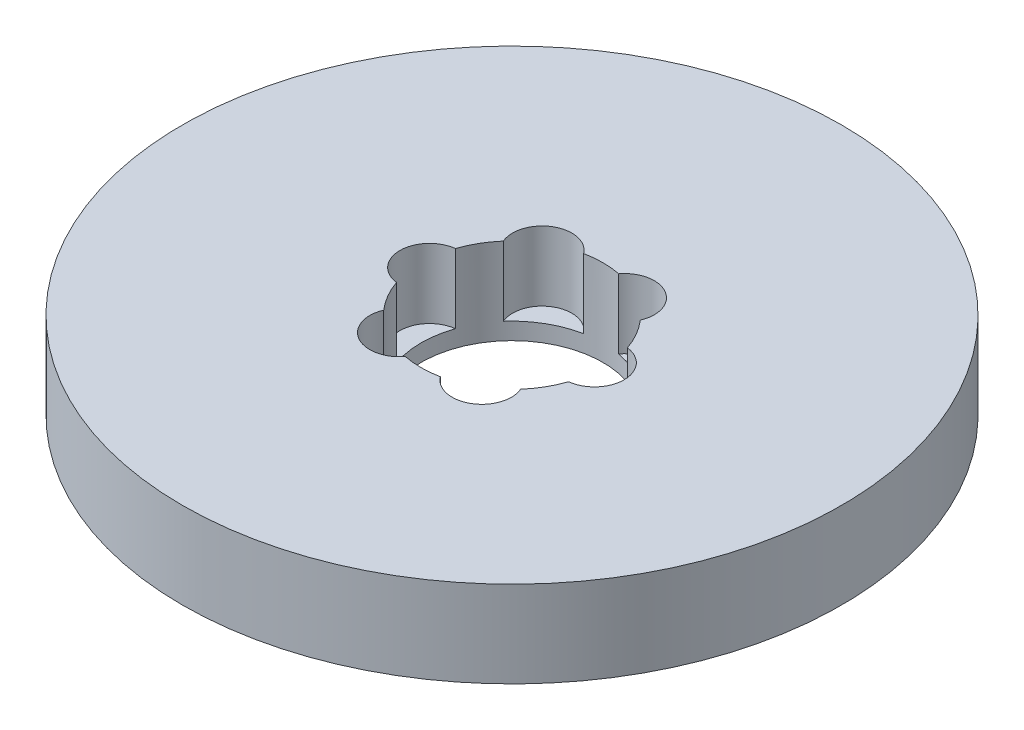
ISO-10303-21;
HEADER;
FILE_DESCRIPTION(('STEP AP214'),'2;1');
FILE_NAME('part.step','',(''),(''),'','','');
FILE_SCHEMA(('AUTOMOTIVE_DESIGN { 1 0 10303 214 1 1 1 1 }'));
ENDSEC;
DATA;
#1=APPLICATION_CONTEXT('core data for automotive mechanical design processes');
#2=APPLICATION_PROTOCOL_DEFINITION('international standard','automotive_design',2000,#1);
#3=PRODUCT_CONTEXT('',#1,'mechanical');
#4=PRODUCT('Part','Part','',(#3));
#5=PRODUCT_RELATED_PRODUCT_CATEGORY('part','',(#4));
#6=PRODUCT_DEFINITION_FORMATION('','',#4);
#7=PRODUCT_DEFINITION_CONTEXT('part definition',#1,'design');
#8=PRODUCT_DEFINITION('design','',#6,#7);
#9=PRODUCT_DEFINITION_SHAPE('','',#8);
#10=(LENGTH_UNIT() NAMED_UNIT(*) SI_UNIT(.MILLI.,.METRE.));
#11=(NAMED_UNIT(*) PLANE_ANGLE_UNIT() SI_UNIT($,.RADIAN.));
#12=(NAMED_UNIT(*) SI_UNIT($,.STERADIAN.) SOLID_ANGLE_UNIT());
#13=UNCERTAINTY_MEASURE_WITH_UNIT(LENGTH_MEASURE(1.E-05),#10,'distance_accuracy_value','');
#14=(GEOMETRIC_REPRESENTATION_CONTEXT(3) GLOBAL_UNCERTAINTY_ASSIGNED_CONTEXT((#13)) GLOBAL_UNIT_ASSIGNED_CONTEXT((#10,
#11,#12)) REPRESENTATION_CONTEXT('',''));
#15=CARTESIAN_POINT('',(0.,0.,0.));
#16=DIRECTION('',(0.,0.,1.));
#17=DIRECTION('',(1.,0.,0.));
#18=AXIS2_PLACEMENT_3D('',#15,#16,#17);
#19=CARTESIAN_POINT('',(0.,19.,0.));
#20=DIRECTION('',(0.,-1.,0.));
#21=DIRECTION('',(0.,0.,-1.));
#22=AXIS2_PLACEMENT_3D('',#19,#20,#21);
#23=CYLINDRICAL_SURFACE('',#22,72.5);
#24=CARTESIAN_POINT('',(0.,19.,0.));
#25=DIRECTION('',(0.,1.,0.));
#26=DIRECTION('',(0.,0.,1.));
#27=AXIS2_PLACEMENT_3D('',#24,#25,#26);
#28=CIRCLE('',#27,72.5);
#29=CARTESIAN_POINT('',(0.,19.,72.5));
#30=VERTEX_POINT('',#29);
#31=EDGE_CURVE('E162',#30,#30,#28,.T.);
#32=ORIENTED_EDGE('',*,*,#31,.F.);
#33=EDGE_LOOP('',(#32));
#34=FACE_BOUND('',#33,.T.);
#35=CARTESIAN_POINT('',(0.,0.,0.));
#36=DIRECTION('',(0.,1.,0.));
#37=DIRECTION('',(0.,0.,1.));
#38=AXIS2_PLACEMENT_3D('',#35,#36,#37);
#39=CIRCLE('',#38,72.5);
#40=CARTESIAN_POINT('',(0.,0.,72.5));
#41=VERTEX_POINT('',#40);
#42=EDGE_CURVE('E157',#41,#41,#39,.T.);
#43=ORIENTED_EDGE('',*,*,#42,.T.);
#44=EDGE_LOOP('',(#43));
#45=FACE_BOUND('',#44,.T.);
#46=ADVANCED_FACE('F39',(#34,#45),#23,.T.);
#47=CARTESIAN_POINT('',(0.,19.,0.));
#48=DIRECTION('',(0.,1.,0.));
#49=DIRECTION('',(0.,0.,1.));
#50=AXIS2_PLACEMENT_3D('',#47,#48,#49);
#51=PLANE('',#50);
#52=CARTESIAN_POINT('',(-9.06860523652961,19.,-15.707285023454));
#53=DIRECTION('',(0.,1.,0.));
#54=DIRECTION('',(-0.866025403784433,0.,0.50000000000001));
#55=AXIS2_PLACEMENT_3D('',#52,#53,#54);
#56=CIRCLE('',#55,6.5172243467947);
#57=CARTESIAN_POINT('',(-3.85965017921883,19.,-19.624043938344));
#58=VERTEX_POINT('',#57);
#59=CARTESIAN_POINT('',(-15.0650954859788,19.,-13.1545770740963));
#60=VERTEX_POINT('',#59);
#61=EDGE_CURVE('E218',#58,#60,#56,.T.);
#62=ORIENTED_EDGE('',*,*,#61,.F.);
#63=CARTESIAN_POINT('',(0.,19.,0.));
#64=DIRECTION('',(0.,1.,0.));
#65=DIRECTION('',(0.,0.,1.));
#66=AXIS2_PLACEMENT_3D('',#63,#64,#65);
#67=CIRCLE('',#66,20.);
#68=CARTESIAN_POINT('',(3.85965017921842,19.,-19.6240439383441));
#69=VERTEX_POINT('',#68);
#70=EDGE_CURVE('E169',#69,#58,#67,.T.);
#71=ORIENTED_EDGE('',*,*,#70,.F.);
#72=CARTESIAN_POINT('',(9.06860523652928,19.,-15.7072850234542));
#73=DIRECTION('',(0.,1.,0.));
#74=DIRECTION('',(-0.866025403784443,0.,-0.499999999999992));
#75=AXIS2_PLACEMENT_3D('',#72,#73,#74);
#76=CIRCLE('',#75,6.5172243467947);
#77=CARTESIAN_POINT('',(15.0650954859785,19.,-13.1545770740966));
#78=VERTEX_POINT('',#77);
#79=EDGE_CURVE('E285',#78,#69,#76,.T.);
#80=ORIENTED_EDGE('',*,*,#79,.F.);
#81=CARTESIAN_POINT('',(18.9247456651973,19.,-6.46946686424756));
#82=VERTEX_POINT('',#81);
#83=EDGE_CURVE('E174',#82,#78,#67,.T.);
#84=ORIENTED_EDGE('',*,*,#83,.F.);
#85=CARTESIAN_POINT('',(18.1372104730589,19.,0.));
#86=DIRECTION('',(0.,1.,0.));
#87=DIRECTION('',(0.,0.,-1.));
#88=AXIS2_PLACEMENT_3D('',#85,#86,#87);
#89=CIRCLE('',#88,6.5172243467947);
#90=CARTESIAN_POINT('',(18.9247456651973,19.,6.46946686424756));
#91=VERTEX_POINT('',#90);
#92=EDGE_CURVE('E280',#91,#82,#89,.T.);
#93=ORIENTED_EDGE('',*,*,#92,.F.);
#94=CARTESIAN_POINT('',(15.0650954859787,19.,13.1545770740964));
#95=VERTEX_POINT('',#94);
#96=EDGE_CURVE('E164',#95,#91,#67,.T.);
#97=ORIENTED_EDGE('',*,*,#96,.F.);
#98=CARTESIAN_POINT('',(9.0686052365295,19.,15.7072850234541));
#99=DIRECTION('',(0.,1.,0.));
#100=DIRECTION('',(0.866025403784436,0.,-0.500000000000004));
#101=AXIS2_PLACEMENT_3D('',#98,#99,#100);
#102=CIRCLE('',#101,6.5172243467947);
#103=CARTESIAN_POINT('',(3.85965017921869,19.,19.624043938344));
#104=VERTEX_POINT('',#103);
#105=EDGE_CURVE('E269',#104,#95,#102,.T.);
#106=ORIENTED_EDGE('',*,*,#105,.F.);
#107=CARTESIAN_POINT('',(-3.85965017921856,19.,19.6240439383441));
#108=VERTEX_POINT('',#107);
#109=EDGE_CURVE('E149',#108,#104,#67,.T.);
#110=ORIENTED_EDGE('',*,*,#109,.F.);
#111=CARTESIAN_POINT('',(-9.06860523652939,19.,15.7072850234542));
#112=DIRECTION('',(0.,1.,0.));
#113=DIRECTION('',(0.86602540378444,0.,0.499999999999998));
#114=AXIS2_PLACEMENT_3D('',#111,#112,#113);
#115=CIRCLE('',#114,6.5172243467947);
#116=CARTESIAN_POINT('',(-15.0650954859786,19.,13.1545770740965));
#117=VERTEX_POINT('',#116);
#118=EDGE_CURVE('E128',#117,#108,#115,.T.);
#119=ORIENTED_EDGE('',*,*,#118,.F.);
#120=CARTESIAN_POINT('',(-18.9247456651973,19.,6.46946686424756));
#121=VERTEX_POINT('',#120);
#122=EDGE_CURVE('E148',#121,#117,#67,.T.);
#123=ORIENTED_EDGE('',*,*,#122,.F.);
#124=CARTESIAN_POINT('',(-18.1372104730589,19.,0.));
#125=DIRECTION('',(0.,1.,0.));
#126=DIRECTION('',(0.,0.,1.));
#127=AXIS2_PLACEMENT_3D('',#124,#125,#126);
#128=CIRCLE('',#127,6.5172243467947);
#129=CARTESIAN_POINT('',(-18.9247456651973,19.,-6.46946686424756));
#130=VERTEX_POINT('',#129);
#131=EDGE_CURVE('E179',#130,#121,#128,.T.);
#132=ORIENTED_EDGE('',*,*,#131,.F.);
#133=EDGE_CURVE('E161',#60,#130,#67,.T.);
#134=ORIENTED_EDGE('',*,*,#133,.F.);
#135=EDGE_LOOP('',(#62,#71,#80,#84,#93,#97,#106,#110,#119,#123,#132,#134));
#136=FACE_BOUND('',#135,.T.);
#137=ORIENTED_EDGE('',*,*,#31,.T.);
#138=EDGE_LOOP('',(#137));
#139=FACE_BOUND('',#138,.T.);
#140=ADVANCED_FACE('F141',(#136,#139),#51,.T.);
#141=CARTESIAN_POINT('',(0.,0.,0.));
#142=DIRECTION('',(0.,1.,0.));
#143=DIRECTION('',(0.,0.,1.));
#144=AXIS2_PLACEMENT_3D('',#141,#142,#143);
#145=PLANE('',#144);
#146=CARTESIAN_POINT('',(0.,0.,0.));
#147=DIRECTION('',(0.,1.,0.));
#148=DIRECTION('',(0.,0.,1.));
#149=AXIS2_PLACEMENT_3D('',#146,#147,#148);
#150=CIRCLE('',#149,20.);
#151=CARTESIAN_POINT('',(0.,0.,20.));
#152=VERTEX_POINT('',#151);
#153=EDGE_CURVE('E166',#152,#152,#150,.T.);
#154=ORIENTED_EDGE('',*,*,#153,.T.);
#155=EDGE_LOOP('',(#154));
#156=FACE_BOUND('',#155,.T.);
#157=ORIENTED_EDGE('',*,*,#42,.F.);
#158=EDGE_LOOP('',(#157));
#159=FACE_BOUND('',#158,.T.);
#160=ADVANCED_FACE('F234',(#156,#159),#145,.F.);
#161=CARTESIAN_POINT('',(0.,19.,0.));
#162=DIRECTION('',(0.,-1.,0.));
#163=DIRECTION('',(0.,0.,-1.));
#164=AXIS2_PLACEMENT_3D('',#161,#162,#163);
#165=CYLINDRICAL_SURFACE('',#164,20.);
#166=DIRECTION('',(0.,1.,0.));
#167=VECTOR('',#166,1.);
#168=CARTESIAN_POINT('',(-3.85965017921883,11.3619927747728,-19.624043938344));
#169=LINE('',#168,#167);
#170=CARTESIAN_POINT('',(-3.85965017921883,3.7239855495456,-19.624043938344));
#171=VERTEX_POINT('',#170);
#172=EDGE_CURVE('E11',#171,#58,#169,.T.);
#173=ORIENTED_EDGE('',*,*,#172,.F.);
#174=CARTESIAN_POINT('',(0.,3.7239855495456,0.));
#175=DIRECTION('',(0.,1.,0.));
#176=DIRECTION('',(0.,0.,1.));
#177=AXIS2_PLACEMENT_3D('',#174,#175,#176);
#178=CIRCLE('',#177,20.);
#179=CARTESIAN_POINT('',(-15.0650954859788,3.7239855495456,-13.1545770740963));
#180=VERTEX_POINT('',#179);
#181=EDGE_CURVE('E214',#171,#180,#178,.T.);
#182=ORIENTED_EDGE('',*,*,#181,.T.);
#183=DIRECTION('',(0.,1.,0.));
#184=VECTOR('',#183,1.);
#185=CARTESIAN_POINT('',(-15.0650954859788,11.3619927747728,-13.1545770740963));
#186=LINE('',#185,#184);
#187=EDGE_CURVE('E46',#60,#180,#186,.F.);
#188=ORIENTED_EDGE('',*,*,#187,.F.);
#189=ORIENTED_EDGE('',*,*,#133,.T.);
#190=DIRECTION('',(0.,1.,0.));
#191=VECTOR('',#190,1.);
#192=CARTESIAN_POINT('',(-18.9247456651973,11.3619927747728,-6.46946686424756));
#193=LINE('',#192,#191);
#194=CARTESIAN_POINT('',(-18.9247456651973,3.7239855495456,-6.46946686424756));
#195=VERTEX_POINT('',#194);
#196=EDGE_CURVE('E187',#195,#130,#193,.T.);
#197=ORIENTED_EDGE('',*,*,#196,.F.);
#198=CARTESIAN_POINT('',(0.,3.7239855495456,0.));
#199=DIRECTION('',(0.,1.,0.));
#200=DIRECTION('',(0.,0.,1.));
#201=AXIS2_PLACEMENT_3D('',#198,#199,#200);
#202=CIRCLE('',#201,20.);
#203=CARTESIAN_POINT('',(-18.9247456651973,3.7239855495456,6.46946686424756));
#204=VERTEX_POINT('',#203);
#205=EDGE_CURVE('E184',#195,#204,#202,.T.);
#206=ORIENTED_EDGE('',*,*,#205,.T.);
#207=DIRECTION('',(0.,1.,0.));
#208=VECTOR('',#207,1.);
#209=CARTESIAN_POINT('',(-18.9247456651973,11.3619927747728,6.46946686424756));
#210=LINE('',#209,#208);
#211=EDGE_CURVE('E158',#121,#204,#210,.F.);
#212=ORIENTED_EDGE('',*,*,#211,.F.);
#213=ORIENTED_EDGE('',*,*,#122,.T.);
#214=DIRECTION('',(0.,1.,0.));
#215=VECTOR('',#214,1.);
#216=CARTESIAN_POINT('',(-15.0650954859786,11.3619927747728,13.1545770740965));
#217=LINE('',#216,#215);
#218=CARTESIAN_POINT('',(-15.0650954859786,3.7239855495456,13.1545770740965));
#219=VERTEX_POINT('',#218);
#220=EDGE_CURVE('E127',#219,#117,#217,.T.);
#221=ORIENTED_EDGE('',*,*,#220,.F.);
#222=CARTESIAN_POINT('',(0.,3.7239855495456,0.));
#223=DIRECTION('',(0.,1.,0.));
#224=DIRECTION('',(0.,0.,1.));
#225=AXIS2_PLACEMENT_3D('',#222,#223,#224);
#226=CIRCLE('',#225,20.);
#227=CARTESIAN_POINT('',(-3.85965017921856,3.7239855495456,19.6240439383441));
#228=VERTEX_POINT('',#227);
#229=EDGE_CURVE('E189',#219,#228,#226,.T.);
#230=ORIENTED_EDGE('',*,*,#229,.T.);
#231=DIRECTION('',(0.,1.,0.));
#232=VECTOR('',#231,1.);
#233=CARTESIAN_POINT('',(-3.85965017921856,11.3619927747728,19.6240439383441));
#234=LINE('',#233,#232);
#235=EDGE_CURVE('E140',#108,#228,#234,.F.);
#236=ORIENTED_EDGE('',*,*,#235,.F.);
#237=ORIENTED_EDGE('',*,*,#109,.T.);
#238=DIRECTION('',(0.,1.,0.));
#239=VECTOR('',#238,1.);
#240=CARTESIAN_POINT('',(3.85965017921869,11.3619927747728,19.624043938344));
#241=LINE('',#240,#239);
#242=CARTESIAN_POINT('',(3.85965017921869,3.7239855495456,19.624043938344));
#243=VERTEX_POINT('',#242);
#244=EDGE_CURVE('E196',#243,#104,#241,.T.);
#245=ORIENTED_EDGE('',*,*,#244,.F.);
#246=CARTESIAN_POINT('',(0.,3.7239855495456,0.));
#247=DIRECTION('',(0.,1.,0.));
#248=DIRECTION('',(0.,0.,1.));
#249=AXIS2_PLACEMENT_3D('',#246,#247,#248);
#250=CIRCLE('',#249,20.);
#251=CARTESIAN_POINT('',(15.0650954859787,3.7239855495456,13.1545770740964));
#252=VERTEX_POINT('',#251);
#253=EDGE_CURVE('E136',#243,#252,#250,.T.);
#254=ORIENTED_EDGE('',*,*,#253,.T.);
#255=DIRECTION('',(0.,1.,0.));
#256=VECTOR('',#255,1.);
#257=CARTESIAN_POINT('',(15.0650954859787,11.3619927747728,13.1545770740964));
#258=LINE('',#257,#256);
#259=EDGE_CURVE('E194',#95,#252,#258,.F.);
#260=ORIENTED_EDGE('',*,*,#259,.F.);
#261=ORIENTED_EDGE('',*,*,#96,.T.);
#262=DIRECTION('',(0.,1.,0.));
#263=VECTOR('',#262,1.);
#264=CARTESIAN_POINT('',(18.9247456651973,11.3619927747728,6.46946686424756));
#265=LINE('',#264,#263);
#266=CARTESIAN_POINT('',(18.9247456651973,3.7239855495456,6.46946686424756));
#267=VERTEX_POINT('',#266);
#268=EDGE_CURVE('E206',#267,#91,#265,.T.);
#269=ORIENTED_EDGE('',*,*,#268,.F.);
#270=CARTESIAN_POINT('',(0.,3.7239855495456,0.));
#271=DIRECTION('',(0.,1.,0.));
#272=DIRECTION('',(0.,0.,1.));
#273=AXIS2_PLACEMENT_3D('',#270,#271,#272);
#274=CIRCLE('',#273,20.);
#275=CARTESIAN_POINT('',(18.9247456651973,3.7239855495456,-6.46946686424756));
#276=VERTEX_POINT('',#275);
#277=EDGE_CURVE('E199',#267,#276,#274,.T.);
#278=ORIENTED_EDGE('',*,*,#277,.T.);
#279=DIRECTION('',(0.,1.,0.));
#280=VECTOR('',#279,1.);
#281=CARTESIAN_POINT('',(18.9247456651973,11.3619927747728,-6.46946686424756));
#282=LINE('',#281,#280);
#283=EDGE_CURVE('E201',#82,#276,#282,.F.);
#284=ORIENTED_EDGE('',*,*,#283,.F.);
#285=ORIENTED_EDGE('',*,*,#83,.T.);
#286=DIRECTION('',(0.,1.,0.));
#287=VECTOR('',#286,1.);
#288=CARTESIAN_POINT('',(15.0650954859785,11.3619927747728,-13.1545770740966));
#289=LINE('',#288,#287);
#290=CARTESIAN_POINT('',(15.0650954859785,3.7239855495456,-13.1545770740966));
#291=VERTEX_POINT('',#290);
#292=EDGE_CURVE('E213',#291,#78,#289,.T.);
#293=ORIENTED_EDGE('',*,*,#292,.F.);
#294=CARTESIAN_POINT('',(0.,3.7239855495456,0.));
#295=DIRECTION('',(0.,1.,0.));
#296=DIRECTION('',(0.,0.,1.));
#297=AXIS2_PLACEMENT_3D('',#294,#295,#296);
#298=CIRCLE('',#297,20.);
#299=CARTESIAN_POINT('',(3.85965017921842,3.7239855495456,-19.6240439383441));
#300=VERTEX_POINT('',#299);
#301=EDGE_CURVE('E208',#291,#300,#298,.T.);
#302=ORIENTED_EDGE('',*,*,#301,.T.);
#303=DIRECTION('',(0.,1.,0.));
#304=VECTOR('',#303,1.);
#305=CARTESIAN_POINT('',(3.85965017921842,11.3619927747728,-19.6240439383441));
#306=LINE('',#305,#304);
#307=EDGE_CURVE('E211',#69,#300,#306,.F.);
#308=ORIENTED_EDGE('',*,*,#307,.F.);
#309=ORIENTED_EDGE('',*,*,#70,.T.);
#310=EDGE_LOOP('',(#173,#182,#188,#189,#197,#206,#212,#213,#221,#230,#236,#237,#245,#254,#260,
#261,#269,#278,#284,#285,#293,#302,#308,#309));
#311=FACE_BOUND('',#310,.T.);
#312=ORIENTED_EDGE('',*,*,#153,.F.);
#313=EDGE_LOOP('',(#312));
#314=FACE_BOUND('',#313,.T.);
#315=ADVANCED_FACE('F152',(#311,#314),#165,.F.);
#316=CARTESIAN_POINT('',(-18.1372104730589,3.7239855495456,0.));
#317=DIRECTION('',(0.,1.,0.));
#318=DIRECTION('',(0.,0.,1.));
#319=AXIS2_PLACEMENT_3D('',#316,#317,#318);
#320=CYLINDRICAL_SURFACE('',#319,6.5172243467947);
#321=ORIENTED_EDGE('',*,*,#196,.T.);
#322=ORIENTED_EDGE('',*,*,#131,.T.);
#323=ORIENTED_EDGE('',*,*,#211,.T.);
#324=CARTESIAN_POINT('',(-18.1372104730589,3.7239855495456,0.));
#325=DIRECTION('',(0.,1.,0.));
#326=DIRECTION('',(0.,0.,1.));
#327=AXIS2_PLACEMENT_3D('',#324,#325,#326);
#328=CIRCLE('',#327,6.5172243467947);
#329=EDGE_CURVE('E180',#195,#204,#328,.T.);
#330=ORIENTED_EDGE('',*,*,#329,.F.);
#331=EDGE_LOOP('',(#321,#322,#323,#330));
#332=FACE_BOUND('',#331,.T.);
#333=ADVANCED_FACE('F244',(#332),#320,.F.);
#334=CARTESIAN_POINT('',(-18.1372104730589,3.7239855495456,0.));
#335=DIRECTION('',(0.,1.,0.));
#336=DIRECTION('',(0.,0.,1.));
#337=AXIS2_PLACEMENT_3D('',#334,#335,#336);
#338=PLANE('',#337);
#339=ORIENTED_EDGE('',*,*,#329,.T.);
#340=ORIENTED_EDGE('',*,*,#205,.F.);
#341=EDGE_LOOP('',(#339,#340));
#342=FACE_BOUND('',#341,.T.);
#343=ADVANCED_FACE('F248',(#342),#338,.T.);
#344=CARTESIAN_POINT('',(-9.06860523652939,3.7239855495456,15.7072850234542));
#345=DIRECTION('',(0.,1.,0.));
#346=DIRECTION('',(0.,0.,1.));
#347=AXIS2_PLACEMENT_3D('',#344,#345,#346);
#348=CYLINDRICAL_SURFACE('',#347,6.5172243467947);
#349=ORIENTED_EDGE('',*,*,#220,.T.);
#350=ORIENTED_EDGE('',*,*,#118,.T.);
#351=ORIENTED_EDGE('',*,*,#235,.T.);
#352=CARTESIAN_POINT('',(-9.06860523652939,3.7239855495456,15.7072850234542));
#353=DIRECTION('',(0.,1.,0.));
#354=DIRECTION('',(0.86602540378444,0.,0.499999999999998));
#355=AXIS2_PLACEMENT_3D('',#352,#353,#354);
#356=CIRCLE('',#355,6.5172243467947);
#357=EDGE_CURVE('E135',#219,#228,#356,.T.);
#358=ORIENTED_EDGE('',*,*,#357,.F.);
#359=EDGE_LOOP('',(#349,#350,#351,#358));
#360=FACE_BOUND('',#359,.T.);
#361=ADVANCED_FACE('F126',(#360),#348,.F.);
#362=CARTESIAN_POINT('',(-9.06860523652939,3.7239855495456,15.7072850234542));
#363=DIRECTION('',(0.,1.,0.));
#364=DIRECTION('',(0.86602540378444,0.,0.499999999999998));
#365=AXIS2_PLACEMENT_3D('',#362,#363,#364);
#366=PLANE('',#365);
#367=ORIENTED_EDGE('',*,*,#357,.T.);
#368=ORIENTED_EDGE('',*,*,#229,.F.);
#369=EDGE_LOOP('',(#367,#368));
#370=FACE_BOUND('',#369,.T.);
#371=ADVANCED_FACE('F258',(#370),#366,.T.);
#372=CARTESIAN_POINT('',(9.0686052365295,3.7239855495456,15.7072850234541));
#373=DIRECTION('',(0.,1.,0.));
#374=DIRECTION('',(0.,0.,1.));
#375=AXIS2_PLACEMENT_3D('',#372,#373,#374);
#376=CYLINDRICAL_SURFACE('',#375,6.5172243467947);
#377=ORIENTED_EDGE('',*,*,#244,.T.);
#378=ORIENTED_EDGE('',*,*,#105,.T.);
#379=ORIENTED_EDGE('',*,*,#259,.T.);
#380=CARTESIAN_POINT('',(9.0686052365295,3.7239855495456,15.7072850234541));
#381=DIRECTION('',(0.,1.,0.));
#382=DIRECTION('',(0.866025403784436,0.,-0.500000000000004));
#383=AXIS2_PLACEMENT_3D('',#380,#381,#382);
#384=CIRCLE('',#383,6.5172243467947);
#385=EDGE_CURVE('E147',#243,#252,#384,.T.);
#386=ORIENTED_EDGE('',*,*,#385,.F.);
#387=EDGE_LOOP('',(#377,#378,#379,#386));
#388=FACE_BOUND('',#387,.T.);
#389=ADVANCED_FACE('F256',(#388),#376,.F.);
#390=CARTESIAN_POINT('',(9.0686052365295,3.7239855495456,15.7072850234541));
#391=DIRECTION('',(0.,1.,0.));
#392=DIRECTION('',(0.866025403784436,0.,-0.500000000000004));
#393=AXIS2_PLACEMENT_3D('',#390,#391,#392);
#394=PLANE('',#393);
#395=ORIENTED_EDGE('',*,*,#385,.T.);
#396=ORIENTED_EDGE('',*,*,#253,.F.);
#397=EDGE_LOOP('',(#395,#396));
#398=FACE_BOUND('',#397,.T.);
#399=ADVANCED_FACE('F263',(#398),#394,.T.);
#400=CARTESIAN_POINT('',(18.1372104730589,3.7239855495456,0.));
#401=DIRECTION('',(0.,1.,0.));
#402=DIRECTION('',(0.,0.,1.));
#403=AXIS2_PLACEMENT_3D('',#400,#401,#402);
#404=CYLINDRICAL_SURFACE('',#403,6.5172243467947);
#405=ORIENTED_EDGE('',*,*,#268,.T.);
#406=ORIENTED_EDGE('',*,*,#92,.T.);
#407=ORIENTED_EDGE('',*,*,#283,.T.);
#408=CARTESIAN_POINT('',(18.1372104730589,3.7239855495456,0.));
#409=DIRECTION('',(0.,1.,0.));
#410=DIRECTION('',(0.,0.,-1.));
#411=AXIS2_PLACEMENT_3D('',#408,#409,#410);
#412=CIRCLE('',#411,6.5172243467947);
#413=EDGE_CURVE('E273',#267,#276,#412,.T.);
#414=ORIENTED_EDGE('',*,*,#413,.F.);
#415=EDGE_LOOP('',(#405,#406,#407,#414));
#416=FACE_BOUND('',#415,.T.);
#417=ADVANCED_FACE('F297',(#416),#404,.F.);
#418=CARTESIAN_POINT('',(18.1372104730589,3.7239855495456,0.));
#419=DIRECTION('',(0.,1.,0.));
#420=DIRECTION('',(0.,0.,-1.));
#421=AXIS2_PLACEMENT_3D('',#418,#419,#420);
#422=PLANE('',#421);
#423=ORIENTED_EDGE('',*,*,#413,.T.);
#424=ORIENTED_EDGE('',*,*,#277,.F.);
#425=EDGE_LOOP('',(#423,#424));
#426=FACE_BOUND('',#425,.T.);
#427=ADVANCED_FACE('F299',(#426),#422,.T.);
#428=CARTESIAN_POINT('',(9.06860523652928,3.7239855495456,-15.7072850234542));
#429=DIRECTION('',(0.,1.,0.));
#430=DIRECTION('',(0.,0.,1.));
#431=AXIS2_PLACEMENT_3D('',#428,#429,#430);
#432=CYLINDRICAL_SURFACE('',#431,6.5172243467947);
#433=ORIENTED_EDGE('',*,*,#292,.T.);
#434=ORIENTED_EDGE('',*,*,#79,.T.);
#435=ORIENTED_EDGE('',*,*,#307,.T.);
#436=CARTESIAN_POINT('',(9.06860523652928,3.7239855495456,-15.7072850234542));
#437=DIRECTION('',(0.,1.,0.));
#438=DIRECTION('',(-0.866025403784443,0.,-0.499999999999992));
#439=AXIS2_PLACEMENT_3D('',#436,#437,#438);
#440=CIRCLE('',#439,6.5172243467947);
#441=EDGE_CURVE('E56',#291,#300,#440,.T.);
#442=ORIENTED_EDGE('',*,*,#441,.F.);
#443=EDGE_LOOP('',(#433,#434,#435,#442));
#444=FACE_BOUND('',#443,.T.);
#445=ADVANCED_FACE('F292',(#444),#432,.F.);
#446=CARTESIAN_POINT('',(9.06860523652928,3.7239855495456,-15.7072850234542));
#447=DIRECTION('',(0.,1.,0.));
#448=DIRECTION('',(-0.866025403784443,0.,-0.499999999999992));
#449=AXIS2_PLACEMENT_3D('',#446,#447,#448);
#450=PLANE('',#449);
#451=ORIENTED_EDGE('',*,*,#441,.T.);
#452=ORIENTED_EDGE('',*,*,#301,.F.);
#453=EDGE_LOOP('',(#451,#452));
#454=FACE_BOUND('',#453,.T.);
#455=ADVANCED_FACE('F226',(#454),#450,.T.);
#456=CARTESIAN_POINT('',(-9.06860523652961,3.7239855495456,-15.707285023454));
#457=DIRECTION('',(0.,1.,0.));
#458=DIRECTION('',(0.,0.,1.));
#459=AXIS2_PLACEMENT_3D('',#456,#457,#458);
#460=CYLINDRICAL_SURFACE('',#459,6.5172243467947);
#461=ORIENTED_EDGE('',*,*,#172,.T.);
#462=ORIENTED_EDGE('',*,*,#61,.T.);
#463=ORIENTED_EDGE('',*,*,#187,.T.);
#464=CARTESIAN_POINT('',(-9.06860523652961,3.7239855495456,-15.707285023454));
#465=DIRECTION('',(0.,1.,0.));
#466=DIRECTION('',(-0.866025403784433,0.,0.50000000000001));
#467=AXIS2_PLACEMENT_3D('',#464,#465,#466);
#468=CIRCLE('',#467,6.5172243467947);
#469=EDGE_CURVE('E55',#171,#180,#468,.T.);
#470=ORIENTED_EDGE('',*,*,#469,.F.);
#471=EDGE_LOOP('',(#461,#462,#463,#470));
#472=FACE_BOUND('',#471,.T.);
#473=ADVANCED_FACE('F217',(#472),#460,.F.);
#474=CARTESIAN_POINT('',(-9.06860523652961,3.7239855495456,-15.707285023454));
#475=DIRECTION('',(0.,1.,0.));
#476=DIRECTION('',(-0.866025403784433,0.,0.50000000000001));
#477=AXIS2_PLACEMENT_3D('',#474,#475,#476);
#478=PLANE('',#477);
#479=ORIENTED_EDGE('',*,*,#469,.T.);
#480=ORIENTED_EDGE('',*,*,#181,.F.);
#481=EDGE_LOOP('',(#479,#480));
#482=FACE_BOUND('',#481,.T.);
#483=ADVANCED_FACE('F219',(#482),#478,.T.);
#484=CLOSED_SHELL('',(#46,#140,#160,#315,#333,#343,#361,#371,#389,#399,#417,#427,#445,#455,#473,#483));
#485=MANIFOLD_SOLID_BREP('B2',#484);
#486=ADVANCED_BREP_SHAPE_REPRESENTATION('',(#18,#485),#14);
#487=SHAPE_DEFINITION_REPRESENTATION(#9,#486);
ENDSEC;
END-ISO-10303-21;
